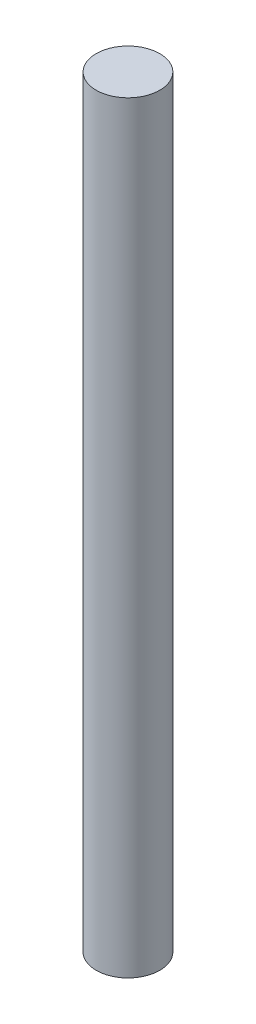
ISO-10303-21;
HEADER;
FILE_DESCRIPTION(('STEP AP214'),'2;1');
FILE_NAME('part.step','',(''),(''),'','','');
FILE_SCHEMA(('AUTOMOTIVE_DESIGN { 1 0 10303 214 1 1 1 1 }'));
ENDSEC;
DATA;
#1=APPLICATION_CONTEXT('core data for automotive mechanical design processes');
#2=APPLICATION_PROTOCOL_DEFINITION('international standard','automotive_design',2000,#1);
#3=PRODUCT_CONTEXT('',#1,'mechanical');
#4=PRODUCT('Part','Part','',(#3));
#5=PRODUCT_RELATED_PRODUCT_CATEGORY('part','',(#4));
#6=PRODUCT_DEFINITION_FORMATION('','',#4);
#7=PRODUCT_DEFINITION_CONTEXT('part definition',#1,'design');
#8=PRODUCT_DEFINITION('design','',#6,#7);
#9=PRODUCT_DEFINITION_SHAPE('','',#8);
#10=(LENGTH_UNIT() NAMED_UNIT(*) SI_UNIT(.MILLI.,.METRE.));
#11=(NAMED_UNIT(*) PLANE_ANGLE_UNIT() SI_UNIT($,.RADIAN.));
#12=(NAMED_UNIT(*) SI_UNIT($,.STERADIAN.) SOLID_ANGLE_UNIT());
#13=UNCERTAINTY_MEASURE_WITH_UNIT(LENGTH_MEASURE(1.E-05),#10,'distance_accuracy_value','');
#14=(GEOMETRIC_REPRESENTATION_CONTEXT(3) GLOBAL_UNCERTAINTY_ASSIGNED_CONTEXT((#13)) GLOBAL_UNIT_ASSIGNED_CONTEXT((#10,
#11,#12)) REPRESENTATION_CONTEXT('',''));
#15=CARTESIAN_POINT('',(0.,0.,0.));
#16=DIRECTION('',(0.,0.,1.));
#17=DIRECTION('',(1.,0.,0.));
#18=AXIS2_PLACEMENT_3D('',#15,#16,#17);
#19=CARTESIAN_POINT('',(0.,0.,0.));
#20=DIRECTION('',(0.,-1.,0.));
#21=DIRECTION('',(1.,0.,0.));
#22=AXIS2_PLACEMENT_3D('',#19,#20,#21);
#23=PLANE('',#22);
#24=CARTESIAN_POINT('',(0.,0.,0.));
#25=DIRECTION('',(0.,1.,0.));
#26=DIRECTION('',(-1.,0.,0.));
#27=AXIS2_PLACEMENT_3D('',#24,#25,#26);
#28=CIRCLE('',#27,1.5875);
#29=CARTESIAN_POINT('',(-1.5875,0.,0.));
#30=VERTEX_POINT('',#29);
#31=EDGE_CURVE('E10',#30,#30,#28,.T.);
#32=ORIENTED_EDGE('',*,*,#31,.F.);
#33=EDGE_LOOP('',(#32));
#34=FACE_BOUND('',#33,.T.);
#35=ADVANCED_FACE('F37',(#34),#23,.T.);
#36=CARTESIAN_POINT('',(0.,38.1,0.));
#37=DIRECTION('',(0.,1.,0.));
#38=DIRECTION('',(-1.,0.,0.));
#39=AXIS2_PLACEMENT_3D('',#36,#37,#38);
#40=CYLINDRICAL_SURFACE('',#39,1.5875);
#41=ORIENTED_EDGE('',*,*,#31,.T.);
#42=EDGE_LOOP('',(#41));
#43=FACE_BOUND('',#42,.T.);
#44=CARTESIAN_POINT('',(0.,38.1,0.));
#45=DIRECTION('',(0.,1.,0.));
#46=DIRECTION('',(-1.,0.,0.));
#47=AXIS2_PLACEMENT_3D('',#44,#45,#46);
#48=CIRCLE('',#47,1.5875);
#49=CARTESIAN_POINT('',(-1.5875,38.1,0.));
#50=VERTEX_POINT('',#49);
#51=EDGE_CURVE('E44',#50,#50,#48,.T.);
#52=ORIENTED_EDGE('',*,*,#51,.F.);
#53=EDGE_LOOP('',(#52));
#54=FACE_BOUND('',#53,.T.);
#55=ADVANCED_FACE('F53',(#43,#54),#40,.T.);
#56=CARTESIAN_POINT('',(-1.5875,38.1,0.));
#57=DIRECTION('',(0.,1.,0.));
#58=DIRECTION('',(-1.,0.,0.));
#59=AXIS2_PLACEMENT_3D('',#56,#57,#58);
#60=PLANE('',#59);
#61=ORIENTED_EDGE('',*,*,#51,.T.);
#62=EDGE_LOOP('',(#61));
#63=FACE_BOUND('',#62,.T.);
#64=ADVANCED_FACE('F51',(#63),#60,.T.);
#65=CLOSED_SHELL('',(#35,#55,#64));
#66=MANIFOLD_SOLID_BREP('B2',#65);
#67=ADVANCED_BREP_SHAPE_REPRESENTATION('',(#18,#66),#14);
#68=SHAPE_DEFINITION_REPRESENTATION(#9,#67);
ENDSEC;
END-ISO-10303-21;
